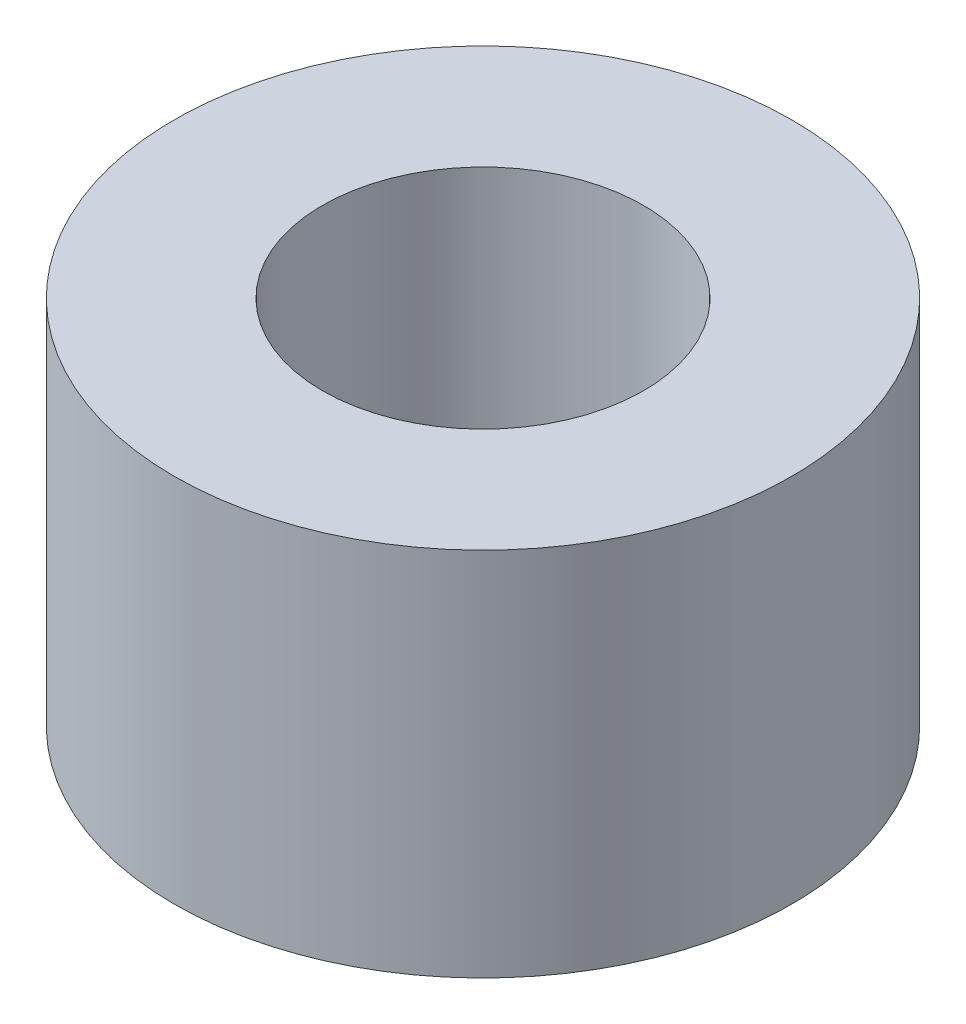
ISO-10303-21;
HEADER;
FILE_DESCRIPTION(('STEP AP214'),'2;1');
FILE_NAME('part.step','',(''),(''),'','','');
FILE_SCHEMA(('AUTOMOTIVE_DESIGN { 1 0 10303 214 1 1 1 1 }'));
ENDSEC;
DATA;
#1=APPLICATION_CONTEXT('core data for automotive mechanical design processes');
#2=APPLICATION_PROTOCOL_DEFINITION('international standard','automotive_design',2000,#1);
#3=PRODUCT_CONTEXT('',#1,'mechanical');
#4=PRODUCT('Part','Part','',(#3));
#5=PRODUCT_RELATED_PRODUCT_CATEGORY('part','',(#4));
#6=PRODUCT_DEFINITION_FORMATION('','',#4);
#7=PRODUCT_DEFINITION_CONTEXT('part definition',#1,'design');
#8=PRODUCT_DEFINITION('design','',#6,#7);
#9=PRODUCT_DEFINITION_SHAPE('','',#8);
#10=(LENGTH_UNIT() NAMED_UNIT(*) SI_UNIT(.MILLI.,.METRE.));
#11=(NAMED_UNIT(*) PLANE_ANGLE_UNIT() SI_UNIT($,.RADIAN.));
#12=(NAMED_UNIT(*) SI_UNIT($,.STERADIAN.) SOLID_ANGLE_UNIT());
#13=UNCERTAINTY_MEASURE_WITH_UNIT(LENGTH_MEASURE(1.E-05),#10,'distance_accuracy_value','');
#14=(GEOMETRIC_REPRESENTATION_CONTEXT(3) GLOBAL_UNCERTAINTY_ASSIGNED_CONTEXT((#13)) GLOBAL_UNIT_ASSIGNED_CONTEXT((#10,
#11,#12)) REPRESENTATION_CONTEXT('',''));
#15=CARTESIAN_POINT('',(0.,0.,0.));
#16=DIRECTION('',(0.,0.,1.));
#17=DIRECTION('',(1.,0.,0.));
#18=AXIS2_PLACEMENT_3D('',#15,#16,#17);
#19=CARTESIAN_POINT('',(0.,15.,0.));
#20=DIRECTION('',(0.,1.,0.));
#21=DIRECTION('',(0.,0.,1.));
#22=AXIS2_PLACEMENT_3D('',#19,#20,#21);
#23=PLANE('',#22);
#24=CARTESIAN_POINT('',(0.,15.,0.));
#25=DIRECTION('',(0.,1.,0.));
#26=DIRECTION('',(0.,0.,1.));
#27=AXIS2_PLACEMENT_3D('',#24,#25,#26);
#28=CIRCLE('',#27,12.5);
#29=CARTESIAN_POINT('',(0.,15.,12.5));
#30=VERTEX_POINT('',#29);
#31=EDGE_CURVE('E10',#30,#30,#28,.T.);
#32=ORIENTED_EDGE('',*,*,#31,.T.);
#33=EDGE_LOOP('',(#32));
#34=FACE_BOUND('',#33,.T.);
#35=CARTESIAN_POINT('',(0.,15.,0.));
#36=DIRECTION('',(0.,1.,0.));
#37=DIRECTION('',(0.,0.,1.));
#38=AXIS2_PLACEMENT_3D('',#35,#36,#37);
#39=CIRCLE('',#38,6.5);
#40=CARTESIAN_POINT('',(0.,15.,6.5));
#41=VERTEX_POINT('',#40);
#42=EDGE_CURVE('E39',#41,#41,#39,.T.);
#43=ORIENTED_EDGE('',*,*,#42,.F.);
#44=EDGE_LOOP('',(#43));
#45=FACE_BOUND('',#44,.T.);
#46=ADVANCED_FACE('F28',(#34,#45),#23,.T.);
#47=CARTESIAN_POINT('',(0.,0.,0.));
#48=DIRECTION('',(0.,1.,0.));
#49=DIRECTION('',(0.,0.,1.));
#50=AXIS2_PLACEMENT_3D('',#47,#48,#49);
#51=PLANE('',#50);
#52=CARTESIAN_POINT('',(0.,0.,0.));
#53=DIRECTION('',(0.,1.,0.));
#54=DIRECTION('',(0.,0.,1.));
#55=AXIS2_PLACEMENT_3D('',#52,#53,#54);
#56=CIRCLE('',#55,12.5);
#57=CARTESIAN_POINT('',(0.,0.,12.5));
#58=VERTEX_POINT('',#57);
#59=EDGE_CURVE('E32',#58,#58,#56,.T.);
#60=ORIENTED_EDGE('',*,*,#59,.F.);
#61=EDGE_LOOP('',(#60));
#62=FACE_BOUND('',#61,.T.);
#63=CARTESIAN_POINT('',(0.,0.,0.));
#64=DIRECTION('',(0.,1.,0.));
#65=DIRECTION('',(0.,0.,1.));
#66=AXIS2_PLACEMENT_3D('',#63,#64,#65);
#67=CIRCLE('',#66,6.5);
#68=CARTESIAN_POINT('',(0.,0.,6.5));
#69=VERTEX_POINT('',#68);
#70=EDGE_CURVE('E41',#69,#69,#67,.T.);
#71=ORIENTED_EDGE('',*,*,#70,.T.);
#72=EDGE_LOOP('',(#71));
#73=FACE_BOUND('',#72,.T.);
#74=ADVANCED_FACE('F51',(#62,#73),#51,.F.);
#75=CARTESIAN_POINT('',(0.,15.,0.));
#76=DIRECTION('',(0.,-1.,0.));
#77=DIRECTION('',(0.,0.,-1.));
#78=AXIS2_PLACEMENT_3D('',#75,#76,#77);
#79=CYLINDRICAL_SURFACE('',#78,12.5);
#80=ORIENTED_EDGE('',*,*,#31,.F.);
#81=EDGE_LOOP('',(#80));
#82=FACE_BOUND('',#81,.T.);
#83=ORIENTED_EDGE('',*,*,#59,.T.);
#84=EDGE_LOOP('',(#83));
#85=FACE_BOUND('',#84,.T.);
#86=ADVANCED_FACE('F30',(#82,#85),#79,.T.);
#87=CARTESIAN_POINT('',(0.,15.,0.));
#88=DIRECTION('',(0.,-1.,0.));
#89=DIRECTION('',(0.,0.,-1.));
#90=AXIS2_PLACEMENT_3D('',#87,#88,#89);
#91=CYLINDRICAL_SURFACE('',#90,6.5);
#92=ORIENTED_EDGE('',*,*,#42,.T.);
#93=EDGE_LOOP('',(#92));
#94=FACE_BOUND('',#93,.T.);
#95=ORIENTED_EDGE('',*,*,#70,.F.);
#96=EDGE_LOOP('',(#95));
#97=FACE_BOUND('',#96,.T.);
#98=ADVANCED_FACE('F47',(#94,#97),#91,.F.);
#99=CLOSED_SHELL('',(#46,#74,#86,#98));
#100=MANIFOLD_SOLID_BREP('B2',#99);
#101=ADVANCED_BREP_SHAPE_REPRESENTATION('',(#18,#100),#14);
#102=SHAPE_DEFINITION_REPRESENTATION(#9,#101);
ENDSEC;
END-ISO-10303-21;
